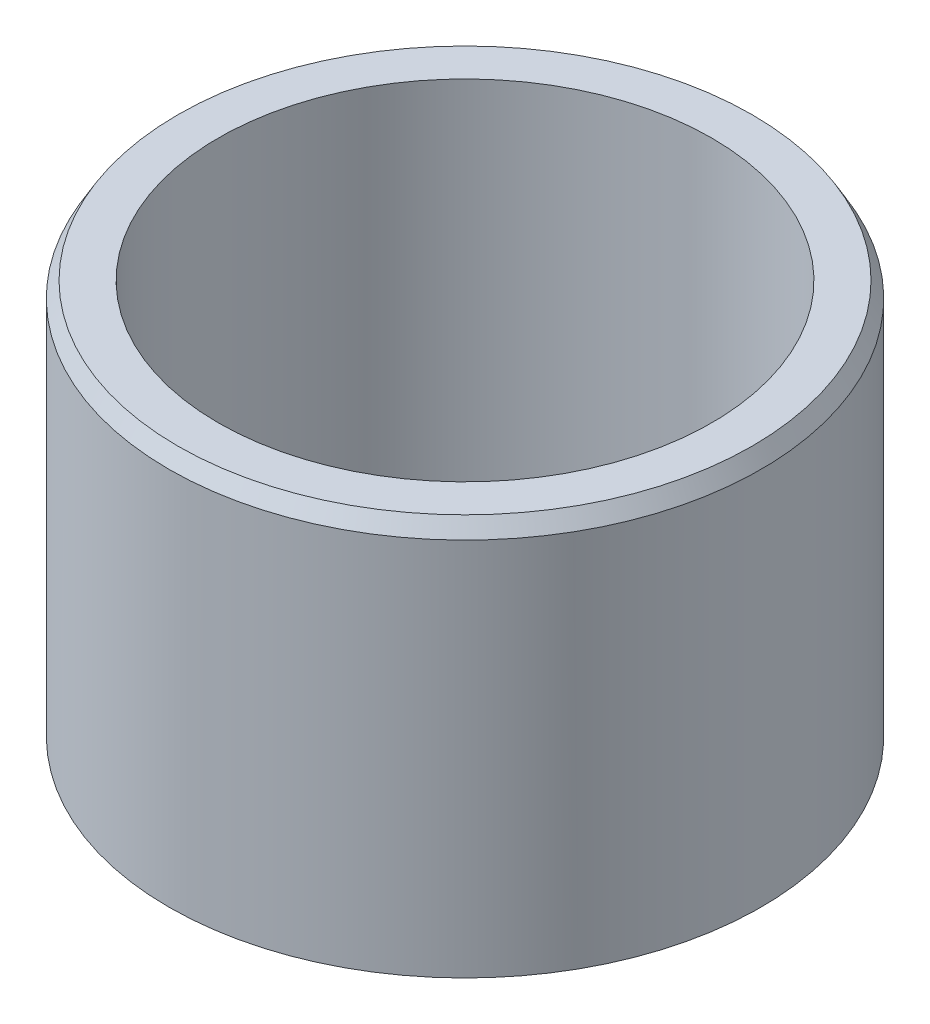
ISO-10303-21;
HEADER;
FILE_DESCRIPTION(('STEP AP214'),'2;1');
FILE_NAME('part.step','',(''),(''),'','','');
FILE_SCHEMA(('AUTOMOTIVE_DESIGN { 1 0 10303 214 1 1 1 1 }'));
ENDSEC;
DATA;
#1=APPLICATION_CONTEXT('core data for automotive mechanical design processes');
#2=APPLICATION_PROTOCOL_DEFINITION('international standard','automotive_design',2000,#1);
#3=PRODUCT_CONTEXT('',#1,'mechanical');
#4=PRODUCT('Part','Part','',(#3));
#5=PRODUCT_RELATED_PRODUCT_CATEGORY('part','',(#4));
#6=PRODUCT_DEFINITION_FORMATION('','',#4);
#7=PRODUCT_DEFINITION_CONTEXT('part definition',#1,'design');
#8=PRODUCT_DEFINITION('design','',#6,#7);
#9=PRODUCT_DEFINITION_SHAPE('','',#8);
#10=(LENGTH_UNIT() NAMED_UNIT(*) SI_UNIT(.MILLI.,.METRE.));
#11=(NAMED_UNIT(*) PLANE_ANGLE_UNIT() SI_UNIT($,.RADIAN.));
#12=(NAMED_UNIT(*) SI_UNIT($,.STERADIAN.) SOLID_ANGLE_UNIT());
#13=UNCERTAINTY_MEASURE_WITH_UNIT(LENGTH_MEASURE(1.E-05),#10,'distance_accuracy_value','');
#14=(GEOMETRIC_REPRESENTATION_CONTEXT(3) GLOBAL_UNCERTAINTY_ASSIGNED_CONTEXT((#13)) GLOBAL_UNIT_ASSIGNED_CONTEXT((#10,
#11,#12)) REPRESENTATION_CONTEXT('',''));
#15=CARTESIAN_POINT('',(0.,0.,0.));
#16=DIRECTION('',(0.,0.,1.));
#17=DIRECTION('',(1.,0.,0.));
#18=AXIS2_PLACEMENT_3D('',#15,#16,#17);
#19=CARTESIAN_POINT('',(0.,21.4398777173913,0.));
#20=DIRECTION('',(0.,1.,0.));
#21=DIRECTION('',(0.,0.,1.));
#22=AXIS2_PLACEMENT_3D('',#19,#20,#21);
#23=CYLINDRICAL_SURFACE('',#22,7.9375);
#24=CARTESIAN_POINT('',(0.,0.,0.));
#25=DIRECTION('',(0.,1.,0.));
#26=DIRECTION('',(0.,0.,1.));
#27=AXIS2_PLACEMENT_3D('',#24,#25,#26);
#28=CIRCLE('',#27,7.9375);
#29=CARTESIAN_POINT('',(0.,0.,7.9375));
#30=VERTEX_POINT('',#29);
#31=EDGE_CURVE('E43',#30,#30,#28,.T.);
#32=ORIENTED_EDGE('',*,*,#31,.F.);
#33=EDGE_LOOP('',(#32));
#34=FACE_BOUND('',#33,.T.);
#35=CARTESIAN_POINT('',(0.,12.7,0.));
#36=DIRECTION('',(0.,1.,0.));
#37=DIRECTION('',(0.,0.,1.));
#38=AXIS2_PLACEMENT_3D('',#35,#36,#37);
#39=CIRCLE('',#38,7.9375);
#40=CARTESIAN_POINT('',(0.,12.7,7.9375));
#41=VERTEX_POINT('',#40);
#42=EDGE_CURVE('E52',#41,#41,#39,.T.);
#43=ORIENTED_EDGE('',*,*,#42,.T.);
#44=EDGE_LOOP('',(#43));
#45=FACE_BOUND('',#44,.T.);
#46=ADVANCED_FACE('F32',(#34,#45),#23,.F.);
#47=CARTESIAN_POINT('',(7.9375,0.,0.));
#48=DIRECTION('',(0.,1.,0.));
#49=DIRECTION('',(0.,0.,1.));
#50=AXIS2_PLACEMENT_3D('',#47,#48,#49);
#51=PLANE('',#50);
#52=CARTESIAN_POINT('',(0.,0.,0.));
#53=DIRECTION('',(0.,1.,0.));
#54=DIRECTION('',(0.,0.,1.));
#55=AXIS2_PLACEMENT_3D('',#52,#53,#54);
#56=CIRCLE('',#55,9.525);
#57=CARTESIAN_POINT('',(0.,0.,9.525));
#58=VERTEX_POINT('',#57);
#59=EDGE_CURVE('E47',#58,#58,#56,.T.);
#60=ORIENTED_EDGE('',*,*,#59,.F.);
#61=EDGE_LOOP('',(#60));
#62=FACE_BOUND('',#61,.T.);
#63=ORIENTED_EDGE('',*,*,#31,.T.);
#64=EDGE_LOOP('',(#63));
#65=FACE_BOUND('',#64,.T.);
#66=ADVANCED_FACE('F66',(#62,#65),#51,.F.);
#67=CARTESIAN_POINT('',(0.,21.4398777173913,0.));
#68=DIRECTION('',(0.,1.,0.));
#69=DIRECTION('',(0.,0.,1.));
#70=AXIS2_PLACEMENT_3D('',#67,#68,#69);
#71=CYLINDRICAL_SURFACE('',#70,9.525);
#72=CARTESIAN_POINT('',(0.,12.19962,0.));
#73=DIRECTION('',(0.,-1.,0.));
#74=DIRECTION('',(0.,0.,-1.));
#75=AXIS2_PLACEMENT_3D('',#72,#73,#74);
#76=CIRCLE('',#75,9.525);
#77=CARTESIAN_POINT('',(0.,12.19962,-9.525));
#78=VERTEX_POINT('',#77);
#79=EDGE_CURVE('E10',#78,#78,#76,.T.);
#80=ORIENTED_EDGE('',*,*,#79,.T.);
#81=EDGE_LOOP('',(#80));
#82=FACE_BOUND('',#81,.T.);
#83=ORIENTED_EDGE('',*,*,#59,.T.);
#84=EDGE_LOOP('',(#83));
#85=FACE_BOUND('',#84,.T.);
#86=ADVANCED_FACE('F59',(#82,#85),#71,.T.);
#87=CARTESIAN_POINT('',(7.9375,12.7,0.));
#88=DIRECTION('',(0.,-1.,0.));
#89=DIRECTION('',(0.,0.,-1.));
#90=AXIS2_PLACEMENT_3D('',#87,#88,#89);
#91=PLANE('',#90);
#92=CARTESIAN_POINT('',(0.,12.7,0.));
#93=DIRECTION('',(0.,-1.,0.));
#94=DIRECTION('',(0.,0.,-1.));
#95=AXIS2_PLACEMENT_3D('',#92,#93,#94);
#96=CIRCLE('',#95,9.23610547230289);
#97=CARTESIAN_POINT('',(0.,12.7,-9.23610547230289));
#98=VERTEX_POINT('',#97);
#99=EDGE_CURVE('E39',#98,#98,#96,.F.);
#100=ORIENTED_EDGE('',*,*,#99,.T.);
#101=EDGE_LOOP('',(#100));
#102=FACE_BOUND('',#101,.T.);
#103=ORIENTED_EDGE('',*,*,#42,.F.);
#104=EDGE_LOOP('',(#103));
#105=FACE_BOUND('',#104,.T.);
#106=ADVANCED_FACE('F57',(#102,#105),#91,.F.);
#107=CARTESIAN_POINT('',(0.,12.7,0.));
#108=DIRECTION('',(0.,-1.,0.));
#109=DIRECTION('',(0.,0.,-1.));
#110=AXIS2_PLACEMENT_3D('',#107,#108,#109);
#111=CONICAL_SURFACE('',#110,9.23610547230289,0.523598775598297);
#112=ORIENTED_EDGE('',*,*,#79,.F.);
#113=EDGE_LOOP('',(#112));
#114=FACE_BOUND('',#113,.T.);
#115=ORIENTED_EDGE('',*,*,#99,.F.);
#116=EDGE_LOOP('',(#115));
#117=FACE_BOUND('',#116,.T.);
#118=ADVANCED_FACE('F34',(#114,#117),#111,.T.);
#119=CLOSED_SHELL('',(#46,#66,#86,#106,#118));
#120=MANIFOLD_SOLID_BREP('B2',#119);
#121=ADVANCED_BREP_SHAPE_REPRESENTATION('',(#18,#120),#14);
#122=SHAPE_DEFINITION_REPRESENTATION(#9,#121);
ENDSEC;
END-ISO-10303-21;
